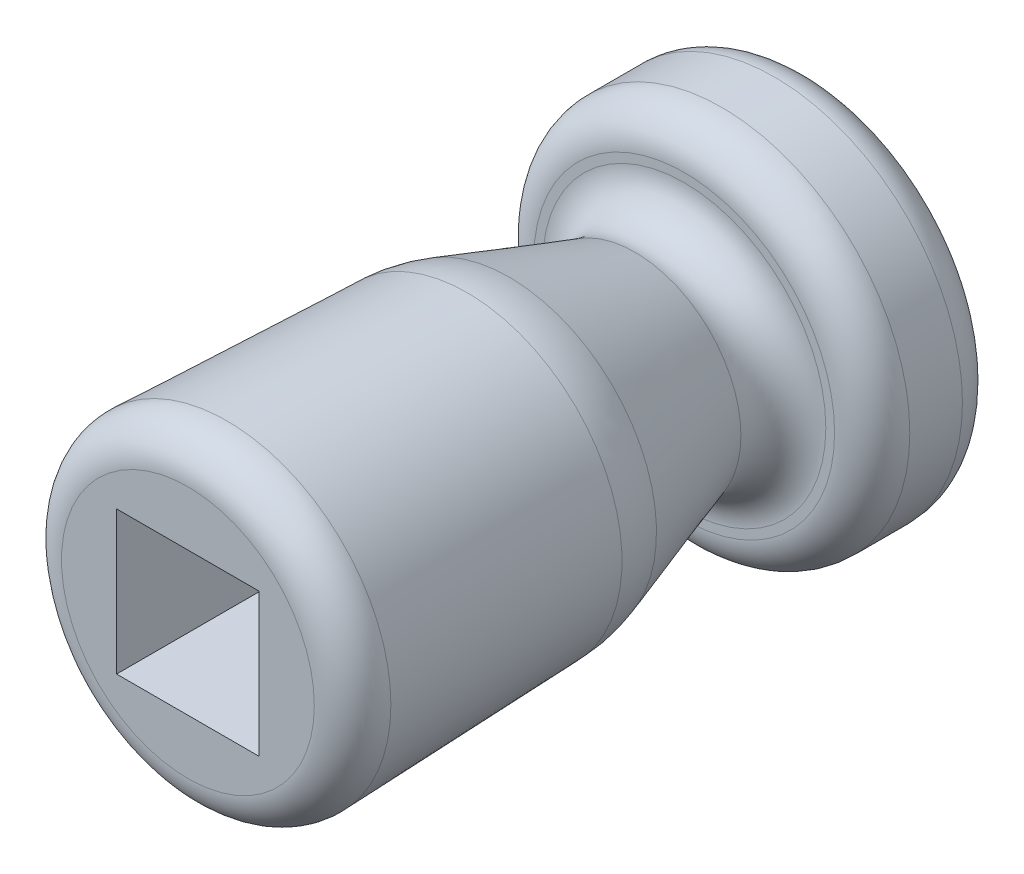
ISO-10303-21;
HEADER;
FILE_DESCRIPTION(('STEP AP214'),'2;1');
FILE_NAME('part.step','',(''),(''),'','','');
FILE_SCHEMA(('AUTOMOTIVE_DESIGN { 1 0 10303 214 1 1 1 1 }'));
ENDSEC;
DATA;
#1=APPLICATION_CONTEXT('core data for automotive mechanical design processes');
#2=APPLICATION_PROTOCOL_DEFINITION('international standard','automotive_design',2000,#1);
#3=PRODUCT_CONTEXT('',#1,'mechanical');
#4=PRODUCT('Part','Part','',(#3));
#5=PRODUCT_RELATED_PRODUCT_CATEGORY('part','',(#4));
#6=PRODUCT_DEFINITION_FORMATION('','',#4);
#7=PRODUCT_DEFINITION_CONTEXT('part definition',#1,'design');
#8=PRODUCT_DEFINITION('design','',#6,#7);
#9=PRODUCT_DEFINITION_SHAPE('','',#8);
#10=(LENGTH_UNIT() NAMED_UNIT(*) SI_UNIT(.MILLI.,.METRE.));
#11=(NAMED_UNIT(*) PLANE_ANGLE_UNIT() SI_UNIT($,.RADIAN.));
#12=(NAMED_UNIT(*) SI_UNIT($,.STERADIAN.) SOLID_ANGLE_UNIT());
#13=UNCERTAINTY_MEASURE_WITH_UNIT(LENGTH_MEASURE(1.E-05),#10,'distance_accuracy_value','');
#14=(GEOMETRIC_REPRESENTATION_CONTEXT(3) GLOBAL_UNCERTAINTY_ASSIGNED_CONTEXT((#13)) GLOBAL_UNIT_ASSIGNED_CONTEXT((#10,
#11,#12)) REPRESENTATION_CONTEXT('',''));
#15=CARTESIAN_POINT('',(0.,0.,0.));
#16=DIRECTION('',(0.,0.,1.));
#17=DIRECTION('',(1.,0.,0.));
#18=AXIS2_PLACEMENT_3D('',#15,#16,#17);
#19=CARTESIAN_POINT('',(0.,0.,7.8));
#20=DIRECTION('',(0.,0.,1.));
#21=DIRECTION('',(1.,0.,0.));
#22=AXIS2_PLACEMENT_3D('',#19,#20,#21);
#23=TOROIDAL_SURFACE('',#22,1.68097761919347,0.5);
#24=CARTESIAN_POINT('',(0.,0.,7.78133921806626));
#25=DIRECTION('',(0.,0.,-1.));
#26=DIRECTION('',(-1.,0.,0.));
#27=AXIS2_PLACEMENT_3D('',#24,#25,#26);
#28=CIRCLE('',#27,2.18062927306607);
#29=CARTESIAN_POINT('',(-2.18062927306607,0.,7.78133921806626));
#30=VERTEX_POINT('',#29);
#31=EDGE_CURVE('E48',#30,#30,#28,.T.);
#32=ORIENTED_EDGE('',*,*,#31,.F.);
#33=EDGE_LOOP('',(#32));
#34=FACE_BOUND('',#33,.T.);
#35=CARTESIAN_POINT('',(0.,0.,8.3));
#36=DIRECTION('',(0.,0.,1.));
#37=DIRECTION('',(1.,0.,0.));
#38=AXIS2_PLACEMENT_3D('',#35,#36,#37);
#39=CIRCLE('',#38,1.68097761919347);
#40=CARTESIAN_POINT('',(1.68097761919347,0.,8.3));
#41=VERTEX_POINT('',#40);
#42=EDGE_CURVE('E12',#41,#41,#39,.T.);
#43=ORIENTED_EDGE('',*,*,#42,.F.);
#44=EDGE_LOOP('',(#43));
#45=FACE_BOUND('',#44,.T.);
#46=ADVANCED_FACE('F41',(#34,#45),#23,.T.);
#47=CARTESIAN_POINT('',(0.,0.,2.2));
#48=DIRECTION('',(0.,0.,1.));
#49=DIRECTION('',(1.,0.,0.));
#50=AXIS2_PLACEMENT_3D('',#47,#48,#49);
#51=TOROIDAL_SURFACE('',#50,1.88328446537705,0.5);
#52=CARTESIAN_POINT('',(0.,0.,1.7));
#53=DIRECTION('',(0.,0.,1.));
#54=DIRECTION('',(1.,0.,0.));
#55=AXIS2_PLACEMENT_3D('',#52,#53,#54);
#56=CIRCLE('',#55,1.88328446537705);
#57=CARTESIAN_POINT('',(1.88328446537705,0.,1.7));
#58=VERTEX_POINT('',#57);
#59=EDGE_CURVE('E136',#58,#58,#56,.F.);
#60=ORIENTED_EDGE('',*,*,#59,.F.);
#61=EDGE_LOOP('',(#60));
#62=FACE_BOUND('',#61,.T.);
#63=CARTESIAN_POINT('',(0.,0.,2.35331492458943));
#64=DIRECTION('',(0.,0.,1.));
#65=DIRECTION('',(1.,0.,0.));
#66=AXIS2_PLACEMENT_3D('',#63,#64,#65);
#67=CIRCLE('',#66,1.40737004670691);
#68=CARTESIAN_POINT('',(0.862807614413088,1.11186935782879,2.35331492458943));
#69=VERTEX_POINT('',#68);
#70=EDGE_CURVE('E139',#69,#69,#67,.T.);
#71=ORIENTED_EDGE('',*,*,#70,.F.);
#72=EDGE_LOOP('',(#71));
#73=FACE_BOUND('',#72,.T.);
#74=ADVANCED_FACE('F149',(#62,#73),#51,.F.);
#75=CARTESIAN_POINT('',(0.,0.,4.66282199646104));
#76=DIRECTION('',(0.,0.,1.));
#77=DIRECTION('',(1.,0.,0.));
#78=AXIS2_PLACEMENT_3D('',#75,#76,#77);
#79=DEGENERATE_TOROIDAL_SURFACE('',#78,0.0627658343535558,2.,.T.);
#80=CARTESIAN_POINT('',(0.,0.,4.02761378639927));
#81=DIRECTION('',(0.,0.,1.));
#82=DIRECTION('',(1.,0.,0.));
#83=AXIS2_PLACEMENT_3D('',#80,#81,#82);
#84=CIRCLE('',#83,1.95921265139592);
#85=CARTESIAN_POINT('',(1.3678382201695,1.40268771179952,4.02761378639927));
#86=VERTEX_POINT('',#85);
#87=EDGE_CURVE('E130',#86,#86,#84,.F.);
#88=ORIENTED_EDGE('',*,*,#87,.F.);
#89=EDGE_LOOP('',(#88));
#90=FACE_BOUND('',#89,.T.);
#91=CARTESIAN_POINT('',(0.,0.,4.58817886872605));
#92=DIRECTION('',(0.,0.,-1.));
#93=DIRECTION('',(-1.,0.,0.));
#94=AXIS2_PLACEMENT_3D('',#91,#92,#93);
#95=CIRCLE('',#94,2.06137244984394);
#96=CARTESIAN_POINT('',(-2.06137244984394,0.,4.58817886872605));
#97=VERTEX_POINT('',#96);
#98=EDGE_CURVE('E133',#97,#97,#95,.F.);
#99=ORIENTED_EDGE('',*,*,#98,.F.);
#100=EDGE_LOOP('',(#99));
#101=FACE_BOUND('',#100,.T.);
#102=ADVANCED_FACE('F203',(#90,#101),#79,.T.);
#103=CARTESIAN_POINT('',(0.,0.,1.2));
#104=DIRECTION('',(0.,0.,1.));
#105=DIRECTION('',(1.,0.,0.));
#106=AXIS2_PLACEMENT_3D('',#103,#104,#105);
#107=TOROIDAL_SURFACE('',#106,2.,0.5);
#108=CARTESIAN_POINT('',(0.,0.,1.2));
#109=DIRECTION('',(0.,0.,1.));
#110=DIRECTION('',(1.,0.,0.));
#111=AXIS2_PLACEMENT_3D('',#108,#109,#110);
#112=CIRCLE('',#111,2.5);
#113=CARTESIAN_POINT('',(2.5,0.,1.2));
#114=VERTEX_POINT('',#113);
#115=EDGE_CURVE('E124',#114,#114,#112,.F.);
#116=ORIENTED_EDGE('',*,*,#115,.F.);
#117=EDGE_LOOP('',(#116));
#118=FACE_BOUND('',#117,.T.);
#119=CARTESIAN_POINT('',(0.,0.,1.7));
#120=DIRECTION('',(0.,0.,1.));
#121=DIRECTION('',(1.,0.,0.));
#122=AXIS2_PLACEMENT_3D('',#119,#120,#121);
#123=CIRCLE('',#122,2.);
#124=CARTESIAN_POINT('',(2.,0.,1.7));
#125=VERTEX_POINT('',#124);
#126=EDGE_CURVE('E127',#125,#125,#123,.T.);
#127=ORIENTED_EDGE('',*,*,#126,.F.);
#128=EDGE_LOOP('',(#127));
#129=FACE_BOUND('',#128,.T.);
#130=ADVANCED_FACE('F189',(#118,#129),#107,.T.);
#131=CARTESIAN_POINT('',(0.,0.,1.7));
#132=DIRECTION('',(0.,0.,1.));
#133=DIRECTION('',(1.,0.,0.));
#134=AXIS2_PLACEMENT_3D('',#131,#132,#133);
#135=PLANE('',#134);
#136=ORIENTED_EDGE('',*,*,#59,.T.);
#137=EDGE_LOOP('',(#136));
#138=FACE_BOUND('',#137,.T.);
#139=ORIENTED_EDGE('',*,*,#126,.T.);
#140=EDGE_LOOP('',(#139));
#141=FACE_BOUND('',#140,.T.);
#142=ADVANCED_FACE('F180',(#138,#141),#135,.T.);
#143=CARTESIAN_POINT('',(0.,0.,0.5));
#144=DIRECTION('',(0.,0.,1.));
#145=DIRECTION('',(1.,0.,0.));
#146=AXIS2_PLACEMENT_3D('',#143,#144,#145);
#147=TOROIDAL_SURFACE('',#146,2.,0.5);
#148=CARTESIAN_POINT('',(0.,0.,0.));
#149=DIRECTION('',(0.,0.,1.));
#150=DIRECTION('',(1.,0.,0.));
#151=AXIS2_PLACEMENT_3D('',#148,#149,#150);
#152=CIRCLE('',#151,2.);
#153=CARTESIAN_POINT('',(2.,0.,0.));
#154=VERTEX_POINT('',#153);
#155=EDGE_CURVE('E116',#154,#154,#152,.F.);
#156=ORIENTED_EDGE('',*,*,#155,.F.);
#157=EDGE_LOOP('',(#156));
#158=FACE_BOUND('',#157,.T.);
#159=CARTESIAN_POINT('',(0.,0.,0.5));
#160=DIRECTION('',(0.,0.,1.));
#161=DIRECTION('',(1.,0.,0.));
#162=AXIS2_PLACEMENT_3D('',#159,#160,#161);
#163=CIRCLE('',#162,2.5);
#164=CARTESIAN_POINT('',(2.5,0.,0.5));
#165=VERTEX_POINT('',#164);
#166=EDGE_CURVE('E121',#165,#165,#163,.T.);
#167=ORIENTED_EDGE('',*,*,#166,.F.);
#168=EDGE_LOOP('',(#167));
#169=FACE_BOUND('',#168,.T.);
#170=ADVANCED_FACE('F188',(#158,#169),#147,.T.);
#171=CARTESIAN_POINT('',(0.,0.,1.7));
#172=DIRECTION('',(0.,0.,-1.));
#173=DIRECTION('',(-1.,0.,0.));
#174=AXIS2_PLACEMENT_3D('',#171,#172,#173);
#175=CYLINDRICAL_SURFACE('',#174,2.5);
#176=ORIENTED_EDGE('',*,*,#115,.T.);
#177=EDGE_LOOP('',(#176));
#178=FACE_BOUND('',#177,.T.);
#179=ORIENTED_EDGE('',*,*,#166,.T.);
#180=EDGE_LOOP('',(#179));
#181=FACE_BOUND('',#180,.T.);
#182=ADVANCED_FACE('F193',(#178,#181),#175,.T.);
#183=CARTESIAN_POINT('',(0.,0.,0.));
#184=DIRECTION('',(0.,0.,1.));
#185=DIRECTION('',(1.,0.,0.));
#186=AXIS2_PLACEMENT_3D('',#183,#184,#185);
#187=PLANE('',#186);
#188=ORIENTED_EDGE('',*,*,#155,.T.);
#189=EDGE_LOOP('',(#188));
#190=FACE_BOUND('',#189,.T.);
#191=ADVANCED_FACE('F178',(#190),#187,.F.);
#192=CARTESIAN_POINT('',(0.665743613689556,0.998391426661693,1.7));
#193=CARTESIAN_POINT('',(1.45,1.45,4.3));
#194=CARTESIAN_POINT('',(-1.33103923963383,2.32987865404081,1.7));
#195=CARTESIAN_POINT('',(-1.45,4.35,4.3));
#196=CARTESIAN_POINT('',(-2.66252646701294,0.333095800717421,1.7));
#197=CARTESIAN_POINT('',(-4.35,1.45,4.3));
#198=CARTESIAN_POINT('',(-0.665743613689557,-0.998391426661692,1.7));
#199=CARTESIAN_POINT('',(-1.45,-1.45,4.3));
#200=CARTESIAN_POINT('',(1.33103923963383,-2.32987865404081,1.7));
#201=CARTESIAN_POINT('',(1.45,-4.35,4.3));
#202=CARTESIAN_POINT('',(2.66252646701294,-0.333095800717421,1.7));
#203=CARTESIAN_POINT('',(4.35,-1.45,4.3));
#204=CARTESIAN_POINT('',(0.665743613689556,0.998391426661693,1.7));
#205=CARTESIAN_POINT('',(1.45,1.45,4.3));
#206=(BOUNDED_SURFACE() B_SPLINE_SURFACE(3,1,((#192,#193),(#194,#195),(#196,#197),(#198,#199),
(#200,#201),(#202,#203),(#204,#205)),.UNSPECIFIED.,.T.,.F.,.F.) B_SPLINE_SURFACE_WITH_KNOTS((4,
3,4),(2,2),(0.,0.5,1.),(0.,1.),
.UNSPECIFIED.) GEOMETRIC_REPRESENTATION_ITEM() RATIONAL_B_SPLINE_SURFACE(((1.,1.),
(0.333333333333333,0.333333333333333),(0.333333333333333,0.333333333333333),(1.,1.),
(0.333333333333333,0.333333333333333),(0.333333333333333,0.333333333333333),(1.,1.))) REPRESENTATION_ITEM('') SURFACE());
#207=CARTESIAN_POINT('',(0.862807614413088,1.11186935782879,2.35331492458943));
#208=CARTESIAN_POINT('',(0.868068349889717,1.11489871568265,2.37075553773328));
#209=CARTESIAN_POINT('',(0.873329085366347,1.11792807353651,2.38819615087713));
#210=CARTESIAN_POINT('',(0.883850556319605,1.12398678924424,2.42307737716484));
#211=CARTESIAN_POINT('',(0.889111291796235,1.1270161470981,2.44051799030869));
#212=CARTESIAN_POINT('',(0.899632762749493,1.13307486280582,2.47539921659639));
#213=CARTESIAN_POINT('',(0.904893498226123,1.13610422065968,2.49283982974025));
#214=CARTESIAN_POINT('',(0.915414969179381,1.14216293636741,2.52772105602795));
#215=CARTESIAN_POINT('',(0.92067570465601,1.14519229422127,2.5451616691718));
#216=CARTESIAN_POINT('',(0.931197175609269,1.15125100992899,2.58004289545951));
#217=CARTESIAN_POINT('',(0.936457911085899,1.15428036778286,2.59748350860336));
#218=CARTESIAN_POINT('',(0.946979382039157,1.16033908349058,2.63236473489107));
#219=CARTESIAN_POINT('',(0.952240117515787,1.16336844134444,2.64980534803492));
#220=CARTESIAN_POINT('',(0.962761588469045,1.16942715705216,2.68468657432262));
#221=CARTESIAN_POINT('',(0.968022323945674,1.17245651490603,2.70212718746648));
#222=CARTESIAN_POINT('',(0.978543794898933,1.17851523061375,2.73700841375418));
#223=CARTESIAN_POINT('',(0.983804530375562,1.18154458846761,2.75444902689803));
#224=CARTESIAN_POINT('',(0.994326001328821,1.18760330417533,2.78933025318574));
#225=CARTESIAN_POINT('',(0.99958673680545,1.1906326620292,2.80677086632959));
#226=CARTESIAN_POINT('',(1.01010820775871,1.19669137773692,2.8416520926173));
#227=CARTESIAN_POINT('',(1.01536894323534,1.19972073559078,2.85909270576115));
#228=CARTESIAN_POINT('',(1.0258904141886,1.2057794512985,2.89397393204885));
#229=CARTESIAN_POINT('',(1.03115114966523,1.20880880915237,2.91141454519271));
#230=CARTESIAN_POINT('',(1.04167262061848,1.21486752486009,2.94629577148041));
#231=CARTESIAN_POINT('',(1.04693335609511,1.21789688271395,2.96373638462426));
#232=CARTESIAN_POINT('',(1.05745482704837,1.22395559842168,2.99861761091197));
#233=CARTESIAN_POINT('',(1.062715562525,1.22698495627554,3.01605822405582));
#234=CARTESIAN_POINT('',(1.07323703347826,1.23304367198326,3.05093945034353));
#235=CARTESIAN_POINT('',(1.07849776895489,1.23607302983712,3.06838006348738));
#236=CARTESIAN_POINT('',(1.08901923990815,1.24213174554485,3.10326128977509));
#237=CARTESIAN_POINT('',(1.09427997538478,1.24516110339871,3.12070190291894));
#238=CARTESIAN_POINT('',(1.10480144633804,1.25121981910643,3.15558312920664));
#239=CARTESIAN_POINT('',(1.11006218181467,1.25424917696029,3.1730237423505));
#240=CARTESIAN_POINT('',(1.12058365276792,1.26030789266802,3.2079049686382));
#241=CARTESIAN_POINT('',(1.12584438824455,1.26333725052188,3.22534558178205));
#242=CARTESIAN_POINT('',(1.13636585919781,1.2693959662296,3.26022680806976));
#243=CARTESIAN_POINT('',(1.14162659467444,1.27242532408346,3.27766742121361));
#244=CARTESIAN_POINT('',(1.1521480656277,1.27848403979119,3.31254864750132));
#245=CARTESIAN_POINT('',(1.15740880110433,1.28151339764505,3.32998926064517));
#246=CARTESIAN_POINT('',(1.16793027205759,1.28757211335277,3.36487048693287));
#247=CARTESIAN_POINT('',(1.17319100753422,1.29060147120663,3.38231110007673));
#248=CARTESIAN_POINT('',(1.18371247848748,1.29666018691436,3.41719232636443));
#249=CARTESIAN_POINT('',(1.18897321396411,1.29968954476822,3.43463293950828));
#250=CARTESIAN_POINT('',(1.19949468491736,1.30574826047594,3.46951416579599));
#251=CARTESIAN_POINT('',(1.20475542039399,1.3087776183298,3.48695477893984));
#252=CARTESIAN_POINT('',(1.21527689134725,1.31483633403753,3.52183600522755));
#253=CARTESIAN_POINT('',(1.22053762682388,1.31786569189139,3.5392766183714));
#254=CARTESIAN_POINT('',(1.23105909777714,1.32392440759911,3.5741578446591));
#255=CARTESIAN_POINT('',(1.23631983325377,1.32695376545298,3.59159845780296));
#256=CARTESIAN_POINT('',(1.24684130420703,1.3330124811607,3.62647968409066));
#257=CARTESIAN_POINT('',(1.25210203968366,1.33604183901456,3.64392029723451));
#258=CARTESIAN_POINT('',(1.26262351063692,1.34210055472228,3.67880152352222));
#259=CARTESIAN_POINT('',(1.26788424611355,1.34512991257615,3.69624213666607));
#260=CARTESIAN_POINT('',(1.2784057170668,1.35118862828387,3.73112336295378));
#261=CARTESIAN_POINT('',(1.28366645254343,1.35421798613773,3.74856397609763));
#262=CARTESIAN_POINT('',(1.29418792349669,1.36027670184545,3.78344520238534));
#263=CARTESIAN_POINT('',(1.29944865897332,1.36330605969932,3.80088581552919));
#264=CARTESIAN_POINT('',(1.30997012992658,1.36936477540704,3.83576704181689));
#265=CARTESIAN_POINT('',(1.31523086540321,1.3723941332609,3.85320765496075));
#266=CARTESIAN_POINT('',(1.32575233635647,1.37845284896862,3.88808888124845));
#267=CARTESIAN_POINT('',(1.3310130718331,1.38148220682249,3.9055294943923));
#268=CARTESIAN_POINT('',(1.34153454278636,1.38754092253021,3.94041072068001));
#269=CARTESIAN_POINT('',(1.34679527826299,1.39057028038407,3.95785133382386));
#270=CARTESIAN_POINT('',(1.35731674921624,1.3966289960918,3.99273256011157));
#271=CARTESIAN_POINT('',(1.36257748469287,1.39965835394566,4.01017317325542));
#272=CARTESIAN_POINT('',(1.3678382201695,1.40268771179952,4.02761378639927));
#273=B_SPLINE_CURVE_WITH_KNOTS('',3,(#207,#208,#209,#210,#211,#212,#213,#214,#215,#216,#217,
#218,#219,#220,#221,#222,#223,#224,#225,#226,#227,#228,#229,#230,#231,#232,#233,#234,#235,#236,
#237,#238,#239,#240,#241,#242,#243,#244,#245,#246,#247,#248,#249,#250,#251,#252,#253,#254,#255,
#256,#257,#258,#259,#260,#261,#262,#263,#264,#265,#266,#267,#268,#269,#270,#271,#272),
.UNSPECIFIED.,.F.,.F.,(4,2,2,2,2,2,2,2,2,2,2,2,2,2,2,2,2,2,2,2,2,2,2,2,2,2,2,2,2,2,2,2,4),(0.,
0.0554007761891302,0.11080155237826,0.166202328567391,0.221603104756521,0.27700388094565,
0.332404657134781,0.387805433323911,0.443206209513041,0.498606985702171,0.554007761891301,
0.609408538080431,0.664809314269561,0.720210090458691,0.775610866647821,0.831011642836952,
0.886412419026082,0.941813195215212,0.997213971404342,1.05261474759347,1.1080155237826,
1.16341629997173,1.21881707616086,1.27421785234999,1.32961862853912,1.38501940472825,
1.44042018091738,1.49582095710651,1.55122173329564,1.60662250948477,1.6620232856739,
1.71742406186303,1.77282483805216),.UNSPECIFIED.);
#274=EDGE_CURVE('BSEAM155',#69,#86,#273,.T.);
#275=ORIENTED_EDGE('',*,*,#70,.T.);
#276=ORIENTED_EDGE('',*,*,#87,.T.);
#277=ORIENTED_EDGE('',*,*,#274,.T.);
#278=ORIENTED_EDGE('',*,*,#274,.F.);
#279=EDGE_LOOP('',(#275,#277,#276,#278));
#280=FACE_BOUND('',#279,.T.);
#281=ADVANCED_FACE('F155',(#280),#206,.T.);
#282=CARTESIAN_POINT('',(0.,0.,8.3));
#283=DIRECTION('',(0.,0.,1.));
#284=DIRECTION('',(1.,0.,0.));
#285=AXIS2_PLACEMENT_3D('',#282,#283,#284);
#286=PLANE('',#285);
#287=ORIENTED_EDGE('',*,*,#42,.T.);
#288=EDGE_LOOP('',(#287));
#289=FACE_BOUND('',#288,.T.);
#290=DIRECTION('',(0.,1.,0.));
#291=VECTOR('',#290,1.);
#292=CARTESIAN_POINT('',(0.948334210991934,0.951154416823209,8.3));
#293=LINE('',#292,#291);
#294=CARTESIAN_POINT('',(0.948334210991934,-0.951154416823209,8.3));
#295=VERTEX_POINT('',#294);
#296=CARTESIAN_POINT('',(0.948334210991934,0.951154416823209,8.3));
#297=VERTEX_POINT('',#296);
#298=EDGE_CURVE('E55',#295,#297,#293,.T.);
#299=ORIENTED_EDGE('',*,*,#298,.F.);
#300=DIRECTION('',(1.,0.,0.));
#301=VECTOR('',#300,1.);
#302=CARTESIAN_POINT('',(-0.948334210991934,-0.951154416823209,8.3));
#303=LINE('',#302,#301);
#304=CARTESIAN_POINT('',(-0.948334210991934,-0.951154416823209,8.3));
#305=VERTEX_POINT('',#304);
#306=EDGE_CURVE('E106',#305,#295,#303,.T.);
#307=ORIENTED_EDGE('',*,*,#306,.F.);
#308=DIRECTION('',(0.,-1.,0.));
#309=VECTOR('',#308,1.);
#310=CARTESIAN_POINT('',(-0.948334210991934,0.951154416823209,8.3));
#311=LINE('',#310,#309);
#312=CARTESIAN_POINT('',(-0.948334210991934,0.951154416823209,8.3));
#313=VERTEX_POINT('',#312);
#314=EDGE_CURVE('E112',#313,#305,#311,.T.);
#315=ORIENTED_EDGE('',*,*,#314,.F.);
#316=DIRECTION('',(-1.,0.,0.));
#317=VECTOR('',#316,1.);
#318=CARTESIAN_POINT('',(-0.948334210991934,0.951154416823209,8.3));
#319=LINE('',#318,#317);
#320=EDGE_CURVE('E90',#297,#313,#319,.T.);
#321=ORIENTED_EDGE('',*,*,#320,.F.);
#322=EDGE_LOOP('',(#299,#307,#315,#321));
#323=FACE_BOUND('',#322,.T.);
#324=ADVANCED_FACE('F152',(#289,#323),#286,.T.);
#325=CARTESIAN_POINT('',(0.,0.,4.3));
#326=DIRECTION('',(0.,0.,1.));
#327=DIRECTION('',(1.,0.,0.));
#328=AXIS2_PLACEMENT_3D('',#325,#326,#327);
#329=CONICAL_SURFACE('',#328,2.05060966544099,0.0373302334983977);
#330=ORIENTED_EDGE('',*,*,#31,.T.);
#331=EDGE_LOOP('',(#330));
#332=FACE_BOUND('',#331,.T.);
#333=ORIENTED_EDGE('',*,*,#98,.T.);
#334=EDGE_LOOP('',(#333));
#335=FACE_BOUND('',#334,.T.);
#336=ADVANCED_FACE('F144',(#332,#335),#329,.T.);
#337=CARTESIAN_POINT('',(0.948334210991934,0.951154416823209,4.3));
#338=DIRECTION('',(1.,0.,0.));
#339=DIRECTION('',(0.,0.,-1.));
#340=AXIS2_PLACEMENT_3D('',#337,#338,#339);
#341=PLANE('',#340);
#342=ORIENTED_EDGE('',*,*,#298,.T.);
#343=DIRECTION('',(0.,0.,1.));
#344=VECTOR('',#343,1.);
#345=CARTESIAN_POINT('',(0.948334210991934,0.951154416823209,4.3));
#346=LINE('',#345,#344);
#347=CARTESIAN_POINT('',(0.948334210991934,0.951154416823209,4.3));
#348=VERTEX_POINT('',#347);
#349=EDGE_CURVE('E78',#348,#297,#346,.T.);
#350=ORIENTED_EDGE('',*,*,#349,.F.);
#351=DIRECTION('',(0.,1.,0.));
#352=VECTOR('',#351,1.);
#353=CARTESIAN_POINT('',(0.948334210991934,0.951154416823209,4.3));
#354=LINE('',#353,#352);
#355=CARTESIAN_POINT('',(0.948334210991934,-0.951154416823209,4.3));
#356=VERTEX_POINT('',#355);
#357=EDGE_CURVE('E104',#356,#348,#354,.T.);
#358=ORIENTED_EDGE('',*,*,#357,.F.);
#359=DIRECTION('',(0.,0.,1.));
#360=VECTOR('',#359,1.);
#361=CARTESIAN_POINT('',(0.948334210991934,-0.951154416823209,4.3));
#362=LINE('',#361,#360);
#363=EDGE_CURVE('E63',#356,#295,#362,.T.);
#364=ORIENTED_EDGE('',*,*,#363,.T.);
#365=EDGE_LOOP('',(#342,#350,#358,#364));
#366=FACE_BOUND('',#365,.T.);
#367=ADVANCED_FACE('F160',(#366),#341,.F.);
#368=CARTESIAN_POINT('',(-0.948334210991934,-0.951154416823209,4.3));
#369=DIRECTION('',(0.,-1.,0.));
#370=DIRECTION('',(0.,0.,-1.));
#371=AXIS2_PLACEMENT_3D('',#368,#369,#370);
#372=PLANE('',#371);
#373=ORIENTED_EDGE('',*,*,#306,.T.);
#374=ORIENTED_EDGE('',*,*,#363,.F.);
#375=DIRECTION('',(1.,0.,0.));
#376=VECTOR('',#375,1.);
#377=CARTESIAN_POINT('',(-0.948334210991934,-0.951154416823209,4.3));
#378=LINE('',#377,#376);
#379=CARTESIAN_POINT('',(-0.948334210991934,-0.951154416823209,4.3));
#380=VERTEX_POINT('',#379);
#381=EDGE_CURVE('E101',#380,#356,#378,.T.);
#382=ORIENTED_EDGE('',*,*,#381,.F.);
#383=DIRECTION('',(0.,0.,1.));
#384=VECTOR('',#383,1.);
#385=CARTESIAN_POINT('',(-0.948334210991934,-0.951154416823209,4.3));
#386=LINE('',#385,#384);
#387=EDGE_CURVE('E94',#380,#305,#386,.T.);
#388=ORIENTED_EDGE('',*,*,#387,.T.);
#389=EDGE_LOOP('',(#373,#374,#382,#388));
#390=FACE_BOUND('',#389,.T.);
#391=ADVANCED_FACE('F158',(#390),#372,.F.);
#392=CARTESIAN_POINT('',(-0.948334210991934,0.951154416823209,4.3));
#393=DIRECTION('',(-1.,0.,0.));
#394=DIRECTION('',(0.,0.,1.));
#395=AXIS2_PLACEMENT_3D('',#392,#393,#394);
#396=PLANE('',#395);
#397=ORIENTED_EDGE('',*,*,#314,.T.);
#398=ORIENTED_EDGE('',*,*,#387,.F.);
#399=DIRECTION('',(0.,-1.,0.));
#400=VECTOR('',#399,1.);
#401=CARTESIAN_POINT('',(-0.948334210991934,0.951154416823209,4.3));
#402=LINE('',#401,#400);
#403=CARTESIAN_POINT('',(-0.948334210991934,0.951154416823209,4.3));
#404=VERTEX_POINT('',#403);
#405=EDGE_CURVE('E97',#404,#380,#402,.T.);
#406=ORIENTED_EDGE('',*,*,#405,.F.);
#407=DIRECTION('',(0.,0.,1.));
#408=VECTOR('',#407,1.);
#409=CARTESIAN_POINT('',(-0.948334210991934,0.951154416823209,4.3));
#410=LINE('',#409,#408);
#411=EDGE_CURVE('E83',#404,#313,#410,.T.);
#412=ORIENTED_EDGE('',*,*,#411,.T.);
#413=EDGE_LOOP('',(#397,#398,#406,#412));
#414=FACE_BOUND('',#413,.T.);
#415=ADVANCED_FACE('F98',(#414),#396,.F.);
#416=CARTESIAN_POINT('',(-0.948334210991934,0.951154416823209,4.3));
#417=DIRECTION('',(0.,1.,0.));
#418=DIRECTION('',(0.,0.,1.));
#419=AXIS2_PLACEMENT_3D('',#416,#417,#418);
#420=PLANE('',#419);
#421=ORIENTED_EDGE('',*,*,#320,.T.);
#422=ORIENTED_EDGE('',*,*,#411,.F.);
#423=DIRECTION('',(-1.,0.,0.));
#424=VECTOR('',#423,1.);
#425=CARTESIAN_POINT('',(-0.948334210991934,0.951154416823209,4.3));
#426=LINE('',#425,#424);
#427=EDGE_CURVE('E87',#348,#404,#426,.T.);
#428=ORIENTED_EDGE('',*,*,#427,.F.);
#429=ORIENTED_EDGE('',*,*,#349,.T.);
#430=EDGE_LOOP('',(#421,#422,#428,#429));
#431=FACE_BOUND('',#430,.T.);
#432=ADVANCED_FACE('F85',(#431),#420,.F.);
#433=CARTESIAN_POINT('',(0.,0.,4.3));
#434=DIRECTION('',(0.,0.,1.));
#435=DIRECTION('',(1.,0.,0.));
#436=AXIS2_PLACEMENT_3D('',#433,#434,#435);
#437=PLANE('',#436);
#438=ORIENTED_EDGE('',*,*,#357,.T.);
#439=ORIENTED_EDGE('',*,*,#427,.T.);
#440=ORIENTED_EDGE('',*,*,#405,.T.);
#441=ORIENTED_EDGE('',*,*,#381,.T.);
#442=EDGE_LOOP('',(#438,#439,#440,#441));
#443=FACE_BOUND('',#442,.T.);
#444=ADVANCED_FACE('F103',(#443),#437,.T.);
#445=CLOSED_SHELL('',(#46,#74,#102,#130,#142,#170,#182,#191,#281,#324,#336,#367,#391,#415,#432,#444));
#446=MANIFOLD_SOLID_BREP('B2',#445);
#447=ADVANCED_BREP_SHAPE_REPRESENTATION('',(#18,#446),#14);
#448=SHAPE_DEFINITION_REPRESENTATION(#9,#447);
ENDSEC;
END-ISO-10303-21;
